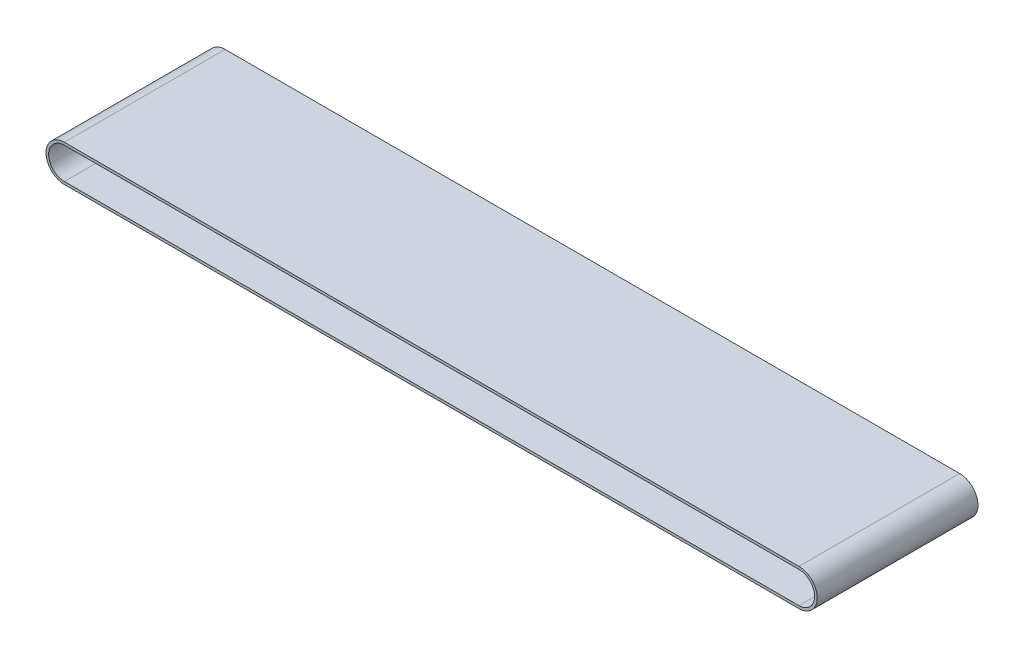
ISO-10303-21;
HEADER;
FILE_DESCRIPTION(('STEP AP214'),'2;1');
FILE_NAME('part.step','',(''),(''),'','','');
FILE_SCHEMA(('AUTOMOTIVE_DESIGN { 1 0 10303 214 1 1 1 1 }'));
ENDSEC;
DATA;
#1=APPLICATION_CONTEXT('core data for automotive mechanical design processes');
#2=APPLICATION_PROTOCOL_DEFINITION('international standard','automotive_design',2000,#1);
#3=PRODUCT_CONTEXT('',#1,'mechanical');
#4=PRODUCT('Part','Part','',(#3));
#5=PRODUCT_RELATED_PRODUCT_CATEGORY('part','',(#4));
#6=PRODUCT_DEFINITION_FORMATION('','',#4);
#7=PRODUCT_DEFINITION_CONTEXT('part definition',#1,'design');
#8=PRODUCT_DEFINITION('design','',#6,#7);
#9=PRODUCT_DEFINITION_SHAPE('','',#8);
#10=(LENGTH_UNIT() NAMED_UNIT(*) SI_UNIT(.MILLI.,.METRE.));
#11=(NAMED_UNIT(*) PLANE_ANGLE_UNIT() SI_UNIT($,.RADIAN.));
#12=(NAMED_UNIT(*) SI_UNIT($,.STERADIAN.) SOLID_ANGLE_UNIT());
#13=UNCERTAINTY_MEASURE_WITH_UNIT(LENGTH_MEASURE(1.E-05),#10,'distance_accuracy_value','');
#14=(GEOMETRIC_REPRESENTATION_CONTEXT(3) GLOBAL_UNCERTAINTY_ASSIGNED_CONTEXT((#13)) GLOBAL_UNIT_ASSIGNED_CONTEXT((#10,
#11,#12)) REPRESENTATION_CONTEXT('',''));
#15=CARTESIAN_POINT('',(0.,0.,0.));
#16=DIRECTION('',(0.,0.,1.));
#17=DIRECTION('',(1.,0.,0.));
#18=AXIS2_PLACEMENT_3D('',#15,#16,#17);
#19=CARTESIAN_POINT('',(-281.,0.,123.));
#20=DIRECTION('',(0.,0.,1.));
#21=DIRECTION('',(1.,0.,0.));
#22=AXIS2_PLACEMENT_3D('',#19,#20,#21);
#23=PLANE('',#22);
#24=CARTESIAN_POINT('',(-281.,0.,123.));
#25=DIRECTION('',(0.,0.,1.));
#26=DIRECTION('',(1.,0.,0.));
#27=AXIS2_PLACEMENT_3D('',#24,#25,#26);
#28=CIRCLE('',#27,14.0000000000001);
#29=CARTESIAN_POINT('',(-281.,14.0000000000001,123.));
#30=VERTEX_POINT('',#29);
#31=CARTESIAN_POINT('',(-281.,-14.0000000000001,123.));
#32=VERTEX_POINT('',#31);
#33=EDGE_CURVE('E140',#30,#32,#28,.T.);
#34=ORIENTED_EDGE('',*,*,#33,.T.);
#35=DIRECTION('',(1.,0.,0.));
#36=VECTOR('',#35,1.);
#37=CARTESIAN_POINT('',(-281.,-14.0000000000001,123.));
#38=LINE('',#37,#36);
#39=CARTESIAN_POINT('',(281.,-14.0000000000001,123.));
#40=VERTEX_POINT('',#39);
#41=EDGE_CURVE('E143',#32,#40,#38,.T.);
#42=ORIENTED_EDGE('',*,*,#41,.T.);
#43=CARTESIAN_POINT('',(281.,0.,123.));
#44=DIRECTION('',(0.,0.,1.));
#45=DIRECTION('',(1.,0.,0.));
#46=AXIS2_PLACEMENT_3D('',#43,#44,#45);
#47=CIRCLE('',#46,14.0000000000001);
#48=CARTESIAN_POINT('',(281.,14.0000000000001,123.));
#49=VERTEX_POINT('',#48);
#50=EDGE_CURVE('E146',#40,#49,#47,.T.);
#51=ORIENTED_EDGE('',*,*,#50,.T.);
#52=DIRECTION('',(-1.,0.,0.));
#53=VECTOR('',#52,1.);
#54=CARTESIAN_POINT('',(-281.,14.0000000000001,123.));
#55=LINE('',#54,#53);
#56=EDGE_CURVE('E148',#49,#30,#55,.T.);
#57=ORIENTED_EDGE('',*,*,#56,.T.);
#58=EDGE_LOOP('',(#34,#42,#51,#57));
#59=FACE_BOUND('',#58,.T.);
#60=DIRECTION('',(1.,0.,0.));
#61=VECTOR('',#60,1.);
#62=CARTESIAN_POINT('',(-281.,-12.,123.));
#63=LINE('',#62,#61);
#64=CARTESIAN_POINT('',(-281.,-12.,123.));
#65=VERTEX_POINT('',#64);
#66=CARTESIAN_POINT('',(281.,-11.9999999999999,123.));
#67=VERTEX_POINT('',#66);
#68=EDGE_CURVE('E112',#65,#67,#63,.T.);
#69=ORIENTED_EDGE('',*,*,#68,.F.);
#70=CARTESIAN_POINT('',(-281.,0.,123.));
#71=DIRECTION('',(0.,0.,1.));
#72=DIRECTION('',(1.,0.,0.));
#73=AXIS2_PLACEMENT_3D('',#70,#71,#72);
#74=CIRCLE('',#73,12.);
#75=CARTESIAN_POINT('',(-281.,12.,123.));
#76=VERTEX_POINT('',#75);
#77=EDGE_CURVE('E104',#76,#65,#74,.T.);
#78=ORIENTED_EDGE('',*,*,#77,.F.);
#79=DIRECTION('',(-1.,0.,0.));
#80=VECTOR('',#79,1.);
#81=CARTESIAN_POINT('',(-281.,12.,123.));
#82=LINE('',#81,#80);
#83=CARTESIAN_POINT('',(281.,12.0000000000001,123.));
#84=VERTEX_POINT('',#83);
#85=EDGE_CURVE('E126',#84,#76,#82,.T.);
#86=ORIENTED_EDGE('',*,*,#85,.F.);
#87=CARTESIAN_POINT('',(281.,1.03237725168122E-13,123.));
#88=DIRECTION('',(0.,0.,1.));
#89=DIRECTION('',(1.,0.,0.));
#90=AXIS2_PLACEMENT_3D('',#87,#88,#89);
#91=CIRCLE('',#90,12.);
#92=EDGE_CURVE('E124',#67,#84,#91,.T.);
#93=ORIENTED_EDGE('',*,*,#92,.F.);
#94=EDGE_LOOP('',(#69,#78,#86,#93));
#95=FACE_BOUND('',#94,.T.);
#96=ADVANCED_FACE('F39',(#59,#95),#23,.T.);
#97=CARTESIAN_POINT('',(-281.,0.,0.));
#98=DIRECTION('',(0.,0.,1.));
#99=DIRECTION('',(1.,0.,0.));
#100=AXIS2_PLACEMENT_3D('',#97,#98,#99);
#101=PLANE('',#100);
#102=CARTESIAN_POINT('',(-281.,0.,0.));
#103=DIRECTION('',(0.,0.,1.));
#104=DIRECTION('',(1.,0.,0.));
#105=AXIS2_PLACEMENT_3D('',#102,#103,#104);
#106=CIRCLE('',#105,14.0000000000001);
#107=CARTESIAN_POINT('',(-281.,14.0000000000001,0.));
#108=VERTEX_POINT('',#107);
#109=CARTESIAN_POINT('',(-281.,-14.0000000000001,0.));
#110=VERTEX_POINT('',#109);
#111=EDGE_CURVE('E120',#108,#110,#106,.T.);
#112=ORIENTED_EDGE('',*,*,#111,.F.);
#113=DIRECTION('',(-1.,0.,0.));
#114=VECTOR('',#113,1.);
#115=CARTESIAN_POINT('',(-281.,14.0000000000001,0.));
#116=LINE('',#115,#114);
#117=CARTESIAN_POINT('',(281.,14.0000000000001,0.));
#118=VERTEX_POINT('',#117);
#119=EDGE_CURVE('E144',#118,#108,#116,.T.);
#120=ORIENTED_EDGE('',*,*,#119,.F.);
#121=CARTESIAN_POINT('',(281.,0.,0.));
#122=DIRECTION('',(0.,0.,1.));
#123=DIRECTION('',(1.,0.,0.));
#124=AXIS2_PLACEMENT_3D('',#121,#122,#123);
#125=CIRCLE('',#124,14.0000000000001);
#126=CARTESIAN_POINT('',(281.,-14.0000000000001,0.));
#127=VERTEX_POINT('',#126);
#128=EDGE_CURVE('E155',#127,#118,#125,.T.);
#129=ORIENTED_EDGE('',*,*,#128,.F.);
#130=DIRECTION('',(1.,0.,0.));
#131=VECTOR('',#130,1.);
#132=CARTESIAN_POINT('',(-281.,-14.0000000000001,0.));
#133=LINE('',#132,#131);
#134=EDGE_CURVE('E153',#110,#127,#133,.T.);
#135=ORIENTED_EDGE('',*,*,#134,.F.);
#136=EDGE_LOOP('',(#112,#120,#129,#135));
#137=FACE_BOUND('',#136,.T.);
#138=CARTESIAN_POINT('',(-281.,0.,0.));
#139=DIRECTION('',(0.,0.,1.));
#140=DIRECTION('',(1.,0.,0.));
#141=AXIS2_PLACEMENT_3D('',#138,#139,#140);
#142=CIRCLE('',#141,12.);
#143=CARTESIAN_POINT('',(-281.,12.,0.));
#144=VERTEX_POINT('',#143);
#145=CARTESIAN_POINT('',(-281.,-12.,0.));
#146=VERTEX_POINT('',#145);
#147=EDGE_CURVE('E62',#144,#146,#142,.T.);
#148=ORIENTED_EDGE('',*,*,#147,.T.);
#149=DIRECTION('',(1.,0.,0.));
#150=VECTOR('',#149,1.);
#151=CARTESIAN_POINT('',(-281.,-12.,0.));
#152=LINE('',#151,#150);
#153=CARTESIAN_POINT('',(281.,-11.9999999999999,0.));
#154=VERTEX_POINT('',#153);
#155=EDGE_CURVE('E119',#146,#154,#152,.T.);
#156=ORIENTED_EDGE('',*,*,#155,.T.);
#157=CARTESIAN_POINT('',(281.,1.03237725168122E-13,0.));
#158=DIRECTION('',(0.,0.,1.));
#159=DIRECTION('',(1.,0.,0.));
#160=AXIS2_PLACEMENT_3D('',#157,#158,#159);
#161=CIRCLE('',#160,12.);
#162=CARTESIAN_POINT('',(281.,12.0000000000001,0.));
#163=VERTEX_POINT('',#162);
#164=EDGE_CURVE('E132',#154,#163,#161,.T.);
#165=ORIENTED_EDGE('',*,*,#164,.T.);
#166=DIRECTION('',(-1.,0.,0.));
#167=VECTOR('',#166,1.);
#168=CARTESIAN_POINT('',(-281.,12.,0.));
#169=LINE('',#168,#167);
#170=EDGE_CURVE('E113',#163,#144,#169,.T.);
#171=ORIENTED_EDGE('',*,*,#170,.T.);
#172=EDGE_LOOP('',(#148,#156,#165,#171));
#173=FACE_BOUND('',#172,.T.);
#174=ADVANCED_FACE('F173',(#137,#173),#101,.F.);
#175=CARTESIAN_POINT('',(-281.,0.,123.));
#176=DIRECTION('',(0.,0.,-1.));
#177=DIRECTION('',(-1.,0.,0.));
#178=AXIS2_PLACEMENT_3D('',#175,#176,#177);
#179=CYLINDRICAL_SURFACE('',#178,14.0000000000001);
#180=ORIENTED_EDGE('',*,*,#111,.T.);
#181=DIRECTION('',(0.,0.,-1.));
#182=VECTOR('',#181,1.);
#183=CARTESIAN_POINT('',(-281.,-14.0000000000001,123.));
#184=LINE('',#183,#182);
#185=EDGE_CURVE('E11',#32,#110,#184,.T.);
#186=ORIENTED_EDGE('',*,*,#185,.F.);
#187=ORIENTED_EDGE('',*,*,#33,.F.);
#188=DIRECTION('',(0.,0.,-1.));
#189=VECTOR('',#188,1.);
#190=CARTESIAN_POINT('',(-281.,14.0000000000001,123.));
#191=LINE('',#190,#189);
#192=EDGE_CURVE('E150',#30,#108,#191,.T.);
#193=ORIENTED_EDGE('',*,*,#192,.T.);
#194=EDGE_LOOP('',(#180,#186,#187,#193));
#195=FACE_BOUND('',#194,.T.);
#196=ADVANCED_FACE('F41',(#195),#179,.T.);
#197=CARTESIAN_POINT('',(-281.,-14.0000000000001,123.));
#198=DIRECTION('',(0.,1.,0.));
#199=DIRECTION('',(0.,0.,1.));
#200=AXIS2_PLACEMENT_3D('',#197,#198,#199);
#201=PLANE('',#200);
#202=ORIENTED_EDGE('',*,*,#134,.T.);
#203=DIRECTION('',(0.,0.,-1.));
#204=VECTOR('',#203,1.);
#205=CARTESIAN_POINT('',(281.,-14.0000000000001,123.));
#206=LINE('',#205,#204);
#207=EDGE_CURVE('E47',#40,#127,#206,.T.);
#208=ORIENTED_EDGE('',*,*,#207,.F.);
#209=ORIENTED_EDGE('',*,*,#41,.F.);
#210=ORIENTED_EDGE('',*,*,#185,.T.);
#211=EDGE_LOOP('',(#202,#208,#209,#210));
#212=FACE_BOUND('',#211,.T.);
#213=ADVANCED_FACE('F183',(#212),#201,.F.);
#214=CARTESIAN_POINT('',(281.,0.,123.));
#215=DIRECTION('',(0.,0.,-1.));
#216=DIRECTION('',(-1.,0.,0.));
#217=AXIS2_PLACEMENT_3D('',#214,#215,#216);
#218=CYLINDRICAL_SURFACE('',#217,14.0000000000001);
#219=ORIENTED_EDGE('',*,*,#128,.T.);
#220=DIRECTION('',(0.,0.,-1.));
#221=VECTOR('',#220,1.);
#222=CARTESIAN_POINT('',(281.,14.0000000000001,123.));
#223=LINE('',#222,#221);
#224=EDGE_CURVE('E160',#49,#118,#223,.T.);
#225=ORIENTED_EDGE('',*,*,#224,.F.);
#226=ORIENTED_EDGE('',*,*,#50,.F.);
#227=ORIENTED_EDGE('',*,*,#207,.T.);
#228=EDGE_LOOP('',(#219,#225,#226,#227));
#229=FACE_BOUND('',#228,.T.);
#230=ADVANCED_FACE('F167',(#229),#218,.T.);
#231=CARTESIAN_POINT('',(-281.,14.0000000000001,123.));
#232=DIRECTION('',(0.,-1.,0.));
#233=DIRECTION('',(0.,0.,-1.));
#234=AXIS2_PLACEMENT_3D('',#231,#232,#233);
#235=PLANE('',#234);
#236=ORIENTED_EDGE('',*,*,#119,.T.);
#237=ORIENTED_EDGE('',*,*,#192,.F.);
#238=ORIENTED_EDGE('',*,*,#56,.F.);
#239=ORIENTED_EDGE('',*,*,#224,.T.);
#240=EDGE_LOOP('',(#236,#237,#238,#239));
#241=FACE_BOUND('',#240,.T.);
#242=ADVANCED_FACE('F177',(#241),#235,.F.);
#243=CARTESIAN_POINT('',(-281.,0.,123.));
#244=DIRECTION('',(0.,0.,-1.));
#245=DIRECTION('',(-1.,0.,0.));
#246=AXIS2_PLACEMENT_3D('',#243,#244,#245);
#247=CYLINDRICAL_SURFACE('',#246,12.);
#248=ORIENTED_EDGE('',*,*,#147,.F.);
#249=DIRECTION('',(0.,0.,-1.));
#250=VECTOR('',#249,1.);
#251=CARTESIAN_POINT('',(-281.,12.,123.));
#252=LINE('',#251,#250);
#253=EDGE_CURVE('E108',#76,#144,#252,.T.);
#254=ORIENTED_EDGE('',*,*,#253,.F.);
#255=ORIENTED_EDGE('',*,*,#77,.T.);
#256=DIRECTION('',(0.,0.,-1.));
#257=VECTOR('',#256,1.);
#258=CARTESIAN_POINT('',(-281.,-12.,123.));
#259=LINE('',#258,#257);
#260=EDGE_CURVE('E107',#65,#146,#259,.T.);
#261=ORIENTED_EDGE('',*,*,#260,.T.);
#262=EDGE_LOOP('',(#248,#254,#255,#261));
#263=FACE_BOUND('',#262,.T.);
#264=ADVANCED_FACE('F106',(#263),#247,.F.);
#265=CARTESIAN_POINT('',(-281.,-12.,123.));
#266=DIRECTION('',(0.,1.,0.));
#267=DIRECTION('',(-1.,0.,0.));
#268=AXIS2_PLACEMENT_3D('',#265,#266,#267);
#269=PLANE('',#268);
#270=ORIENTED_EDGE('',*,*,#155,.F.);
#271=ORIENTED_EDGE('',*,*,#260,.F.);
#272=ORIENTED_EDGE('',*,*,#68,.T.);
#273=DIRECTION('',(0.,0.,-1.));
#274=VECTOR('',#273,1.);
#275=CARTESIAN_POINT('',(281.,-11.9999999999999,123.));
#276=LINE('',#275,#274);
#277=EDGE_CURVE('E121',#67,#154,#276,.T.);
#278=ORIENTED_EDGE('',*,*,#277,.T.);
#279=EDGE_LOOP('',(#270,#271,#272,#278));
#280=FACE_BOUND('',#279,.T.);
#281=ADVANCED_FACE('F116',(#280),#269,.T.);
#282=CARTESIAN_POINT('',(281.,1.03237725168122E-13,123.));
#283=DIRECTION('',(0.,0.,-1.));
#284=DIRECTION('',(-1.,0.,0.));
#285=AXIS2_PLACEMENT_3D('',#282,#283,#284);
#286=CYLINDRICAL_SURFACE('',#285,12.);
#287=ORIENTED_EDGE('',*,*,#164,.F.);
#288=ORIENTED_EDGE('',*,*,#277,.F.);
#289=ORIENTED_EDGE('',*,*,#92,.T.);
#290=DIRECTION('',(0.,0.,-1.));
#291=VECTOR('',#290,1.);
#292=CARTESIAN_POINT('',(281.,12.0000000000001,123.));
#293=LINE('',#292,#291);
#294=EDGE_CURVE('E54',#84,#163,#293,.T.);
#295=ORIENTED_EDGE('',*,*,#294,.T.);
#296=EDGE_LOOP('',(#287,#288,#289,#295));
#297=FACE_BOUND('',#296,.T.);
#298=ADVANCED_FACE('F206',(#297),#286,.F.);
#299=CARTESIAN_POINT('',(-281.,12.,123.));
#300=DIRECTION('',(0.,-1.,0.));
#301=DIRECTION('',(1.,0.,0.));
#302=AXIS2_PLACEMENT_3D('',#299,#300,#301);
#303=PLANE('',#302);
#304=ORIENTED_EDGE('',*,*,#170,.F.);
#305=ORIENTED_EDGE('',*,*,#294,.F.);
#306=ORIENTED_EDGE('',*,*,#85,.T.);
#307=ORIENTED_EDGE('',*,*,#253,.T.);
#308=EDGE_LOOP('',(#304,#305,#306,#307));
#309=FACE_BOUND('',#308,.T.);
#310=ADVANCED_FACE('F210',(#309),#303,.T.);
#311=CLOSED_SHELL('',(#96,#174,#196,#213,#230,#242,#264,#281,#298,#310));
#312=MANIFOLD_SOLID_BREP('B2',#311);
#313=ADVANCED_BREP_SHAPE_REPRESENTATION('',(#18,#312),#14);
#314=SHAPE_DEFINITION_REPRESENTATION(#9,#313);
ENDSEC;
END-ISO-10303-21;
